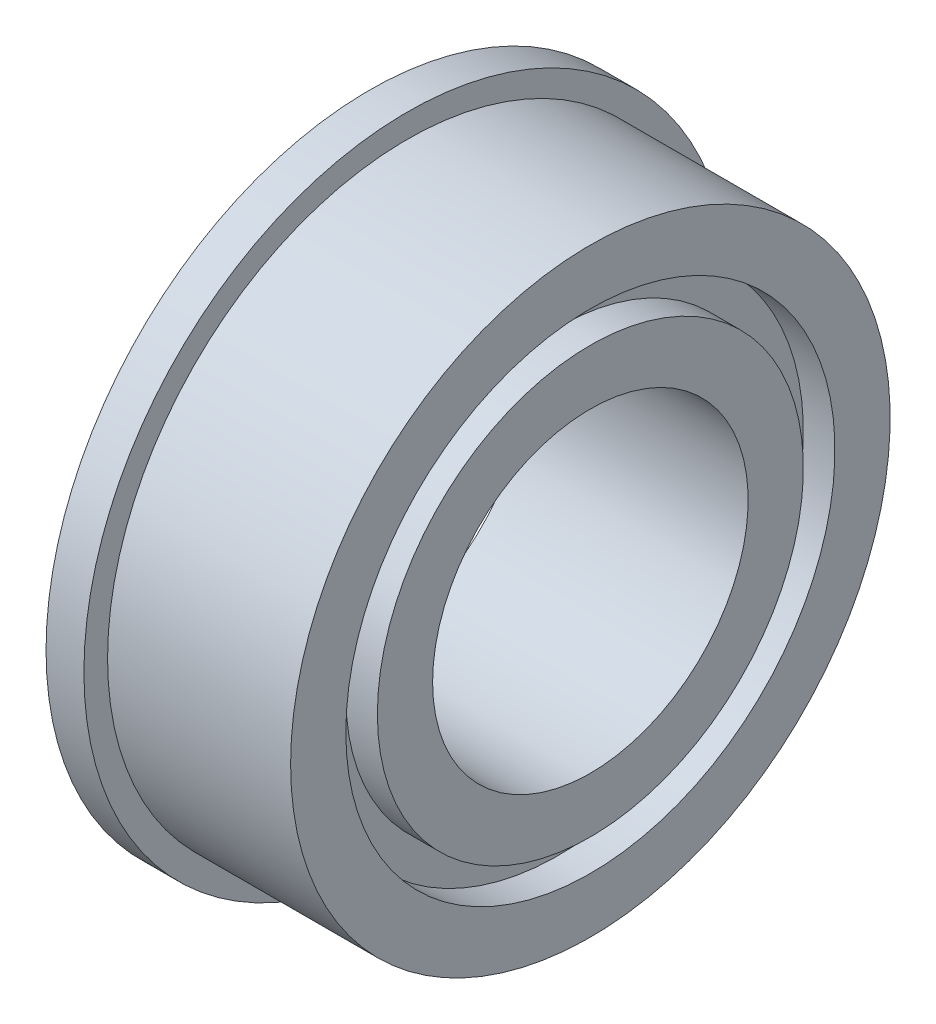
ISO-10303-21;
HEADER;
FILE_DESCRIPTION(('STEP AP214'),'2;1');
FILE_NAME('part.step','',(''),(''),'','','');
FILE_SCHEMA(('AUTOMOTIVE_DESIGN { 1 0 10303 214 1 1 1 1 }'));
ENDSEC;
DATA;
#1=APPLICATION_CONTEXT('core data for automotive mechanical design processes');
#2=APPLICATION_PROTOCOL_DEFINITION('international standard','automotive_design',2000,#1);
#3=PRODUCT_CONTEXT('',#1,'mechanical');
#4=PRODUCT('Part','Part','',(#3));
#5=PRODUCT_RELATED_PRODUCT_CATEGORY('part','',(#4));
#6=PRODUCT_DEFINITION_FORMATION('','',#4);
#7=PRODUCT_DEFINITION_CONTEXT('part definition',#1,'design');
#8=PRODUCT_DEFINITION('design','',#6,#7);
#9=PRODUCT_DEFINITION_SHAPE('','',#8);
#10=(LENGTH_UNIT() NAMED_UNIT(*) SI_UNIT(.MILLI.,.METRE.));
#11=(NAMED_UNIT(*) PLANE_ANGLE_UNIT() SI_UNIT($,.RADIAN.));
#12=(NAMED_UNIT(*) SI_UNIT($,.STERADIAN.) SOLID_ANGLE_UNIT());
#13=UNCERTAINTY_MEASURE_WITH_UNIT(LENGTH_MEASURE(1.E-05),#10,'distance_accuracy_value','');
#14=(GEOMETRIC_REPRESENTATION_CONTEXT(3) GLOBAL_UNCERTAINTY_ASSIGNED_CONTEXT((#13)) GLOBAL_UNIT_ASSIGNED_CONTEXT((#10,
#11,#12)) REPRESENTATION_CONTEXT('',''));
#15=CARTESIAN_POINT('',(0.,0.,0.));
#16=DIRECTION('',(0.,0.,1.));
#17=DIRECTION('',(1.,0.,0.));
#18=AXIS2_PLACEMENT_3D('',#15,#16,#17);
#19=CARTESIAN_POINT('',(-1.2,10.25,0.));
#20=DIRECTION('',(1.,0.,0.));
#21=DIRECTION('',(0.,0.,-1.));
#22=AXIS2_PLACEMENT_3D('',#19,#20,#21);
#23=PLANE('',#22);
#24=CARTESIAN_POINT('',(-1.2,0.,0.));
#25=DIRECTION('',(-1.,0.,0.));
#26=DIRECTION('',(0.,0.,1.));
#27=AXIS2_PLACEMENT_3D('',#24,#25,#26);
#28=CIRCLE('',#27,7.75);
#29=CARTESIAN_POINT('',(-1.2,0.,7.75));
#30=VERTEX_POINT('',#29);
#31=EDGE_CURVE('E10',#30,#30,#28,.T.);
#32=ORIENTED_EDGE('',*,*,#31,.F.);
#33=EDGE_LOOP('',(#32));
#34=FACE_BOUND('',#33,.T.);
#35=CARTESIAN_POINT('',(-1.2,0.,0.));
#36=DIRECTION('',(-1.,0.,0.));
#37=DIRECTION('',(0.,0.,1.));
#38=AXIS2_PLACEMENT_3D('',#35,#36,#37);
#39=CIRCLE('',#38,10.25);
#40=CARTESIAN_POINT('',(-1.2,0.,10.25));
#41=VERTEX_POINT('',#40);
#42=EDGE_CURVE('E75',#41,#41,#39,.T.);
#43=ORIENTED_EDGE('',*,*,#42,.T.);
#44=EDGE_LOOP('',(#43));
#45=FACE_BOUND('',#44,.T.);
#46=ADVANCED_FACE('F29',(#34,#45),#23,.F.);
#47=CARTESIAN_POINT('',(0.,0.,0.));
#48=DIRECTION('',(-1.,0.,0.));
#49=DIRECTION('',(0.,0.,1.));
#50=AXIS2_PLACEMENT_3D('',#47,#48,#49);
#51=CYLINDRICAL_SURFACE('',#50,7.75);
#52=CARTESIAN_POINT('',(-0.199999999999999,0.,0.));
#53=DIRECTION('',(-1.,0.,0.));
#54=DIRECTION('',(0.,0.,1.));
#55=AXIS2_PLACEMENT_3D('',#52,#53,#54);
#56=CIRCLE('',#55,7.75);
#57=CARTESIAN_POINT('',(-0.199999999999999,0.,7.75));
#58=VERTEX_POINT('',#57);
#59=EDGE_CURVE('E35',#58,#58,#56,.T.);
#60=ORIENTED_EDGE('',*,*,#59,.F.);
#61=EDGE_LOOP('',(#60));
#62=FACE_BOUND('',#61,.T.);
#63=ORIENTED_EDGE('',*,*,#31,.T.);
#64=EDGE_LOOP('',(#63));
#65=FACE_BOUND('',#64,.T.);
#66=ADVANCED_FACE('F148',(#62,#65),#51,.F.);
#67=CARTESIAN_POINT('',(-0.199999999999999,6.75,0.));
#68=DIRECTION('',(1.,0.,0.));
#69=DIRECTION('',(0.,0.,-1.));
#70=AXIS2_PLACEMENT_3D('',#67,#68,#69);
#71=PLANE('',#70);
#72=CARTESIAN_POINT('',(-0.199999999999999,0.,0.));
#73=DIRECTION('',(-1.,0.,0.));
#74=DIRECTION('',(0.,0.,1.));
#75=AXIS2_PLACEMENT_3D('',#72,#73,#74);
#76=CIRCLE('',#75,6.75);
#77=CARTESIAN_POINT('',(-0.199999999999999,0.,6.75));
#78=VERTEX_POINT('',#77);
#79=EDGE_CURVE('E39',#78,#78,#76,.T.);
#80=ORIENTED_EDGE('',*,*,#79,.F.);
#81=EDGE_LOOP('',(#80));
#82=FACE_BOUND('',#81,.T.);
#83=ORIENTED_EDGE('',*,*,#59,.T.);
#84=EDGE_LOOP('',(#83));
#85=FACE_BOUND('',#84,.T.);
#86=ADVANCED_FACE('F143',(#82,#85),#71,.F.);
#87=CARTESIAN_POINT('',(0.,0.,0.));
#88=DIRECTION('',(-1.,0.,0.));
#89=DIRECTION('',(0.,0.,1.));
#90=AXIS2_PLACEMENT_3D('',#87,#88,#89);
#91=CYLINDRICAL_SURFACE('',#90,6.75);
#92=CARTESIAN_POINT('',(-1.2,0.,0.));
#93=DIRECTION('',(-1.,0.,0.));
#94=DIRECTION('',(0.,0.,1.));
#95=AXIS2_PLACEMENT_3D('',#92,#93,#94);
#96=CIRCLE('',#95,6.75);
#97=CARTESIAN_POINT('',(-1.2,0.,6.75));
#98=VERTEX_POINT('',#97);
#99=EDGE_CURVE('E43',#98,#98,#96,.T.);
#100=ORIENTED_EDGE('',*,*,#99,.F.);
#101=EDGE_LOOP('',(#100));
#102=FACE_BOUND('',#101,.T.);
#103=ORIENTED_EDGE('',*,*,#79,.T.);
#104=EDGE_LOOP('',(#103));
#105=FACE_BOUND('',#104,.T.);
#106=ADVANCED_FACE('F137',(#102,#105),#91,.T.);
#107=CARTESIAN_POINT('',(-1.2,6.75,0.));
#108=DIRECTION('',(1.,0.,0.));
#109=DIRECTION('',(0.,0.,-1.));
#110=AXIS2_PLACEMENT_3D('',#107,#108,#109);
#111=PLANE('',#110);
#112=CARTESIAN_POINT('',(-1.2,0.,0.));
#113=DIRECTION('',(-1.,0.,0.));
#114=DIRECTION('',(0.,0.,1.));
#115=AXIS2_PLACEMENT_3D('',#112,#113,#114);
#116=CIRCLE('',#115,5.);
#117=CARTESIAN_POINT('',(-1.2,0.,5.));
#118=VERTEX_POINT('',#117);
#119=EDGE_CURVE('E48',#118,#118,#116,.T.);
#120=ORIENTED_EDGE('',*,*,#119,.F.);
#121=EDGE_LOOP('',(#120));
#122=FACE_BOUND('',#121,.T.);
#123=ORIENTED_EDGE('',*,*,#99,.T.);
#124=EDGE_LOOP('',(#123));
#125=FACE_BOUND('',#124,.T.);
#126=ADVANCED_FACE('F131',(#122,#125),#111,.F.);
#127=CARTESIAN_POINT('',(0.,0.,0.));
#128=DIRECTION('',(-1.,0.,0.));
#129=DIRECTION('',(0.,0.,1.));
#130=AXIS2_PLACEMENT_3D('',#127,#128,#129);
#131=CYLINDRICAL_SURFACE('',#130,5.);
#132=CARTESIAN_POINT('',(5.8,0.,0.));
#133=DIRECTION('',(-1.,0.,0.));
#134=DIRECTION('',(0.,0.,1.));
#135=AXIS2_PLACEMENT_3D('',#132,#133,#134);
#136=CIRCLE('',#135,5.);
#137=CARTESIAN_POINT('',(5.8,0.,5.));
#138=VERTEX_POINT('',#137);
#139=EDGE_CURVE('E51',#138,#138,#136,.T.);
#140=ORIENTED_EDGE('',*,*,#139,.F.);
#141=EDGE_LOOP('',(#140));
#142=FACE_BOUND('',#141,.T.);
#143=ORIENTED_EDGE('',*,*,#119,.T.);
#144=EDGE_LOOP('',(#143));
#145=FACE_BOUND('',#144,.T.);
#146=ADVANCED_FACE('F125',(#142,#145),#131,.F.);
#147=CARTESIAN_POINT('',(5.8,6.75,0.));
#148=DIRECTION('',(-1.,0.,0.));
#149=DIRECTION('',(0.,0.,1.));
#150=AXIS2_PLACEMENT_3D('',#147,#148,#149);
#151=PLANE('',#150);
#152=CARTESIAN_POINT('',(5.8,0.,0.));
#153=DIRECTION('',(-1.,0.,0.));
#154=DIRECTION('',(0.,0.,1.));
#155=AXIS2_PLACEMENT_3D('',#152,#153,#154);
#156=CIRCLE('',#155,6.75);
#157=CARTESIAN_POINT('',(5.8,0.,6.75));
#158=VERTEX_POINT('',#157);
#159=EDGE_CURVE('E54',#158,#158,#156,.T.);
#160=ORIENTED_EDGE('',*,*,#159,.F.);
#161=EDGE_LOOP('',(#160));
#162=FACE_BOUND('',#161,.T.);
#163=ORIENTED_EDGE('',*,*,#139,.T.);
#164=EDGE_LOOP('',(#163));
#165=FACE_BOUND('',#164,.T.);
#166=ADVANCED_FACE('F119',(#162,#165),#151,.F.);
#167=CARTESIAN_POINT('',(0.,0.,0.));
#168=DIRECTION('',(-1.,0.,0.));
#169=DIRECTION('',(0.,0.,1.));
#170=AXIS2_PLACEMENT_3D('',#167,#168,#169);
#171=CYLINDRICAL_SURFACE('',#170,6.75);
#172=CARTESIAN_POINT('',(4.8,0.,0.));
#173=DIRECTION('',(-1.,0.,0.));
#174=DIRECTION('',(0.,0.,1.));
#175=AXIS2_PLACEMENT_3D('',#172,#173,#174);
#176=CIRCLE('',#175,6.75);
#177=CARTESIAN_POINT('',(4.8,0.,6.75));
#178=VERTEX_POINT('',#177);
#179=EDGE_CURVE('E57',#178,#178,#176,.T.);
#180=ORIENTED_EDGE('',*,*,#179,.F.);
#181=EDGE_LOOP('',(#180));
#182=FACE_BOUND('',#181,.T.);
#183=ORIENTED_EDGE('',*,*,#159,.T.);
#184=EDGE_LOOP('',(#183));
#185=FACE_BOUND('',#184,.T.);
#186=ADVANCED_FACE('F113',(#182,#185),#171,.T.);
#187=CARTESIAN_POINT('',(4.8,7.75,0.));
#188=DIRECTION('',(-1.,0.,0.));
#189=DIRECTION('',(0.,0.,1.));
#190=AXIS2_PLACEMENT_3D('',#187,#188,#189);
#191=PLANE('',#190);
#192=CARTESIAN_POINT('',(4.8,0.,0.));
#193=DIRECTION('',(-1.,0.,0.));
#194=DIRECTION('',(0.,0.,1.));
#195=AXIS2_PLACEMENT_3D('',#192,#193,#194);
#196=CIRCLE('',#195,7.75);
#197=CARTESIAN_POINT('',(4.8,0.,7.75));
#198=VERTEX_POINT('',#197);
#199=EDGE_CURVE('E60',#198,#198,#196,.T.);
#200=ORIENTED_EDGE('',*,*,#199,.F.);
#201=EDGE_LOOP('',(#200));
#202=FACE_BOUND('',#201,.T.);
#203=ORIENTED_EDGE('',*,*,#179,.T.);
#204=EDGE_LOOP('',(#203));
#205=FACE_BOUND('',#204,.T.);
#206=ADVANCED_FACE('F107',(#202,#205),#191,.F.);
#207=CARTESIAN_POINT('',(0.,0.,0.));
#208=DIRECTION('',(-1.,0.,0.));
#209=DIRECTION('',(0.,0.,1.));
#210=AXIS2_PLACEMENT_3D('',#207,#208,#209);
#211=CYLINDRICAL_SURFACE('',#210,7.75);
#212=CARTESIAN_POINT('',(5.8,0.,0.));
#213=DIRECTION('',(-1.,0.,0.));
#214=DIRECTION('',(0.,0.,1.));
#215=AXIS2_PLACEMENT_3D('',#212,#213,#214);
#216=CIRCLE('',#215,7.75);
#217=CARTESIAN_POINT('',(5.8,0.,7.75));
#218=VERTEX_POINT('',#217);
#219=EDGE_CURVE('E63',#218,#218,#216,.T.);
#220=ORIENTED_EDGE('',*,*,#219,.F.);
#221=EDGE_LOOP('',(#220));
#222=FACE_BOUND('',#221,.T.);
#223=ORIENTED_EDGE('',*,*,#199,.T.);
#224=EDGE_LOOP('',(#223));
#225=FACE_BOUND('',#224,.T.);
#226=ADVANCED_FACE('F101',(#222,#225),#211,.F.);
#227=CARTESIAN_POINT('',(5.8,9.5,0.));
#228=DIRECTION('',(-1.,0.,0.));
#229=DIRECTION('',(0.,0.,1.));
#230=AXIS2_PLACEMENT_3D('',#227,#228,#229);
#231=PLANE('',#230);
#232=CARTESIAN_POINT('',(5.8,0.,0.));
#233=DIRECTION('',(-1.,0.,0.));
#234=DIRECTION('',(0.,0.,1.));
#235=AXIS2_PLACEMENT_3D('',#232,#233,#234);
#236=CIRCLE('',#235,9.5);
#237=CARTESIAN_POINT('',(5.8,0.,9.5));
#238=VERTEX_POINT('',#237);
#239=EDGE_CURVE('E66',#238,#238,#236,.T.);
#240=ORIENTED_EDGE('',*,*,#239,.F.);
#241=EDGE_LOOP('',(#240));
#242=FACE_BOUND('',#241,.T.);
#243=ORIENTED_EDGE('',*,*,#219,.T.);
#244=EDGE_LOOP('',(#243));
#245=FACE_BOUND('',#244,.T.);
#246=ADVANCED_FACE('F95',(#242,#245),#231,.F.);
#247=CARTESIAN_POINT('',(0.,0.,0.));
#248=DIRECTION('',(-1.,0.,0.));
#249=DIRECTION('',(0.,0.,1.));
#250=AXIS2_PLACEMENT_3D('',#247,#248,#249);
#251=CYLINDRICAL_SURFACE('',#250,9.5);
#252=CARTESIAN_POINT('',(0.,0.,0.));
#253=DIRECTION('',(-1.,0.,0.));
#254=DIRECTION('',(0.,0.,1.));
#255=AXIS2_PLACEMENT_3D('',#252,#253,#254);
#256=CIRCLE('',#255,9.5);
#257=CARTESIAN_POINT('',(0.,0.,9.5));
#258=VERTEX_POINT('',#257);
#259=EDGE_CURVE('E69',#258,#258,#256,.T.);
#260=ORIENTED_EDGE('',*,*,#259,.F.);
#261=EDGE_LOOP('',(#260));
#262=FACE_BOUND('',#261,.T.);
#263=ORIENTED_EDGE('',*,*,#239,.T.);
#264=EDGE_LOOP('',(#263));
#265=FACE_BOUND('',#264,.T.);
#266=ADVANCED_FACE('F89',(#262,#265),#251,.T.);
#267=CARTESIAN_POINT('',(0.,10.25,0.));
#268=DIRECTION('',(-1.,0.,0.));
#269=DIRECTION('',(0.,0.,1.));
#270=AXIS2_PLACEMENT_3D('',#267,#268,#269);
#271=PLANE('',#270);
#272=CARTESIAN_POINT('',(0.,0.,0.));
#273=DIRECTION('',(-1.,0.,0.));
#274=DIRECTION('',(0.,0.,1.));
#275=AXIS2_PLACEMENT_3D('',#272,#273,#274);
#276=CIRCLE('',#275,10.25);
#277=CARTESIAN_POINT('',(0.,0.,10.25));
#278=VERTEX_POINT('',#277);
#279=EDGE_CURVE('E72',#278,#278,#276,.T.);
#280=ORIENTED_EDGE('',*,*,#279,.F.);
#281=EDGE_LOOP('',(#280));
#282=FACE_BOUND('',#281,.T.);
#283=ORIENTED_EDGE('',*,*,#259,.T.);
#284=EDGE_LOOP('',(#283));
#285=FACE_BOUND('',#284,.T.);
#286=ADVANCED_FACE('F83',(#282,#285),#271,.F.);
#287=CARTESIAN_POINT('',(0.,0.,0.));
#288=DIRECTION('',(-1.,0.,0.));
#289=DIRECTION('',(0.,0.,1.));
#290=AXIS2_PLACEMENT_3D('',#287,#288,#289);
#291=CYLINDRICAL_SURFACE('',#290,10.25);
#292=ORIENTED_EDGE('',*,*,#42,.F.);
#293=EDGE_LOOP('',(#292));
#294=FACE_BOUND('',#293,.T.);
#295=ORIENTED_EDGE('',*,*,#279,.T.);
#296=EDGE_LOOP('',(#295));
#297=FACE_BOUND('',#296,.T.);
#298=ADVANCED_FACE('F80',(#294,#297),#291,.T.);
#299=CLOSED_SHELL('',(#46,#66,#86,#106,#126,#146,#166,#186,#206,#226,#246,#266,#286,#298));
#300=MANIFOLD_SOLID_BREP('B2',#299);
#301=ADVANCED_BREP_SHAPE_REPRESENTATION('',(#18,#300),#14);
#302=SHAPE_DEFINITION_REPRESENTATION(#9,#301);
ENDSEC;
END-ISO-10303-21;
